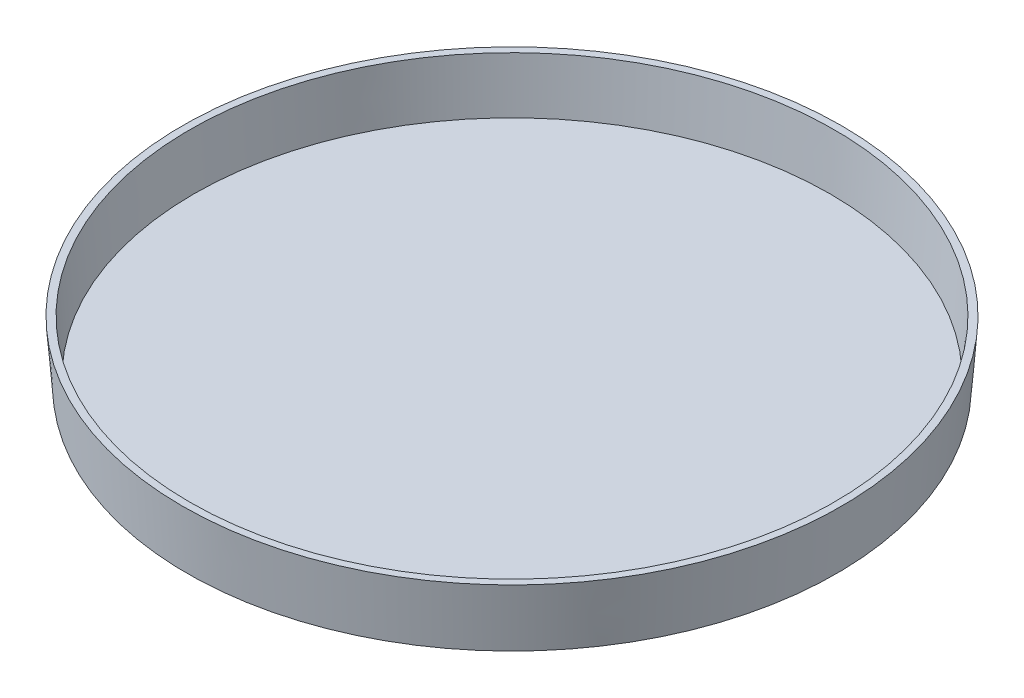
ISO-10303-21;
HEADER;
FILE_DESCRIPTION(('STEP AP214'),'2;1');
FILE_NAME('part.step','',(''),(''),'','','');
FILE_SCHEMA(('AUTOMOTIVE_DESIGN { 1 0 10303 214 1 1 1 1 }'));
ENDSEC;
DATA;
#1=APPLICATION_CONTEXT('core data for automotive mechanical design processes');
#2=APPLICATION_PROTOCOL_DEFINITION('international standard','automotive_design',2000,#1);
#3=PRODUCT_CONTEXT('',#1,'mechanical');
#4=PRODUCT('Part','Part','',(#3));
#5=PRODUCT_RELATED_PRODUCT_CATEGORY('part','',(#4));
#6=PRODUCT_DEFINITION_FORMATION('','',#4);
#7=PRODUCT_DEFINITION_CONTEXT('part definition',#1,'design');
#8=PRODUCT_DEFINITION('design','',#6,#7);
#9=PRODUCT_DEFINITION_SHAPE('','',#8);
#10=(LENGTH_UNIT() NAMED_UNIT(*) SI_UNIT(.MILLI.,.METRE.));
#11=(NAMED_UNIT(*) PLANE_ANGLE_UNIT() SI_UNIT($,.RADIAN.));
#12=(NAMED_UNIT(*) SI_UNIT($,.STERADIAN.) SOLID_ANGLE_UNIT());
#13=UNCERTAINTY_MEASURE_WITH_UNIT(LENGTH_MEASURE(1.E-05),#10,'distance_accuracy_value','');
#14=(GEOMETRIC_REPRESENTATION_CONTEXT(3) GLOBAL_UNCERTAINTY_ASSIGNED_CONTEXT((#13)) GLOBAL_UNIT_ASSIGNED_CONTEXT((#10,
#11,#12)) REPRESENTATION_CONTEXT('',''));
#15=CARTESIAN_POINT('',(0.,0.,0.));
#16=DIRECTION('',(0.,0.,1.));
#17=DIRECTION('',(1.,0.,0.));
#18=AXIS2_PLACEMENT_3D('',#15,#16,#17);
#19=CARTESIAN_POINT('',(0.,8.6614,0.));
#20=DIRECTION('',(0.,1.,0.));
#21=DIRECTION('',(0.,0.,1.));
#22=AXIS2_PLACEMENT_3D('',#19,#20,#21);
#23=PLANE('',#22);
#24=CARTESIAN_POINT('',(0.,8.6614,0.));
#25=DIRECTION('',(0.,1.,0.));
#26=DIRECTION('',(0.,0.,1.));
#27=AXIS2_PLACEMENT_3D('',#24,#25,#26);
#28=CIRCLE('',#27,46.0725366792057);
#29=CARTESIAN_POINT('',(0.,8.6614,46.0725366792057));
#30=VERTEX_POINT('',#29);
#31=EDGE_CURVE('E43',#30,#30,#28,.F.);
#32=ORIENTED_EDGE('',*,*,#31,.T.);
#33=EDGE_LOOP('',(#32));
#34=FACE_BOUND('',#33,.T.);
#35=CARTESIAN_POINT('',(0.,8.6614,0.));
#36=DIRECTION('',(0.,-1.,0.));
#37=DIRECTION('',(0.,0.,-1.));
#38=AXIS2_PLACEMENT_3D('',#35,#36,#37);
#39=CIRCLE('',#38,47.0916);
#40=CARTESIAN_POINT('',(0.,8.6614,-47.0916));
#41=VERTEX_POINT('',#40);
#42=EDGE_CURVE('E10',#41,#41,#39,.T.);
#43=ORIENTED_EDGE('',*,*,#42,.F.);
#44=EDGE_LOOP('',(#43));
#45=FACE_BOUND('',#44,.T.);
#46=ADVANCED_FACE('F33',(#34,#45),#23,.T.);
#47=CARTESIAN_POINT('',(0.,0.,0.));
#48=DIRECTION('',(0.,1.,0.));
#49=DIRECTION('',(0.,0.,1.));
#50=AXIS2_PLACEMENT_3D('',#47,#48,#49);
#51=CONICAL_SURFACE('',#50,46.4185,0.0775567324585586);
#52=ORIENTED_EDGE('',*,*,#42,.T.);
#53=EDGE_LOOP('',(#52));
#54=FACE_BOUND('',#53,.T.);
#55=CARTESIAN_POINT('',(0.,0.,0.));
#56=DIRECTION('',(0.,-1.,0.));
#57=DIRECTION('',(0.,0.,-1.));
#58=AXIS2_PLACEMENT_3D('',#55,#56,#57);
#59=CIRCLE('',#58,46.4185);
#60=CARTESIAN_POINT('',(0.,0.,-46.4185));
#61=VERTEX_POINT('',#60);
#62=EDGE_CURVE('E39',#61,#61,#59,.T.);
#63=ORIENTED_EDGE('',*,*,#62,.F.);
#64=EDGE_LOOP('',(#63));
#65=FACE_BOUND('',#64,.T.);
#66=ADVANCED_FACE('F66',(#54,#65),#51,.T.);
#67=CARTESIAN_POINT('',(0.,0.,0.));
#68=DIRECTION('',(0.,-1.,0.));
#69=DIRECTION('',(0.,0.,-1.));
#70=AXIS2_PLACEMENT_3D('',#67,#68,#69);
#71=PLANE('',#70);
#72=ORIENTED_EDGE('',*,*,#62,.T.);
#73=EDGE_LOOP('',(#72));
#74=FACE_BOUND('',#73,.T.);
#75=ADVANCED_FACE('F61',(#74),#71,.T.);
#76=CARTESIAN_POINT('',(0.,0.0787186686842601,0.));
#77=DIRECTION('',(0.,1.,0.));
#78=DIRECTION('',(0.,0.,1.));
#79=AXIS2_PLACEMENT_3D('',#76,#77,#78);
#80=CONICAL_SURFACE('',#79,45.4055541124025,0.0775567324585586);
#81=ORIENTED_EDGE('',*,*,#31,.F.);
#82=EDGE_LOOP('',(#81));
#83=FACE_BOUND('',#82,.T.);
#84=CARTESIAN_POINT('',(0.,1.016,0.));
#85=DIRECTION('',(0.,-1.,0.));
#86=DIRECTION('',(0.,0.,-1.));
#87=AXIS2_PLACEMENT_3D('',#84,#85,#86);
#88=CIRCLE('',#87,45.4783926909359);
#89=CARTESIAN_POINT('',(0.,1.016,-45.4783926909359));
#90=VERTEX_POINT('',#89);
#91=EDGE_CURVE('E47',#90,#90,#88,.T.);
#92=ORIENTED_EDGE('',*,*,#91,.T.);
#93=EDGE_LOOP('',(#92));
#94=FACE_BOUND('',#93,.T.);
#95=ADVANCED_FACE('F53',(#83,#94),#80,.F.);
#96=CARTESIAN_POINT('',(0.,1.016,0.));
#97=DIRECTION('',(0.,-1.,0.));
#98=DIRECTION('',(0.,0.,-1.));
#99=AXIS2_PLACEMENT_3D('',#96,#97,#98);
#100=PLANE('',#99);
#101=ORIENTED_EDGE('',*,*,#91,.F.);
#102=EDGE_LOOP('',(#101));
#103=FACE_BOUND('',#102,.T.);
#104=ADVANCED_FACE('F55',(#103),#100,.F.);
#105=CLOSED_SHELL('',(#46,#66,#75,#95,#104));
#106=MANIFOLD_SOLID_BREP('B2',#105);
#107=ADVANCED_BREP_SHAPE_REPRESENTATION('',(#18,#106),#14);
#108=SHAPE_DEFINITION_REPRESENTATION(#9,#107);
ENDSEC;
END-ISO-10303-21;
